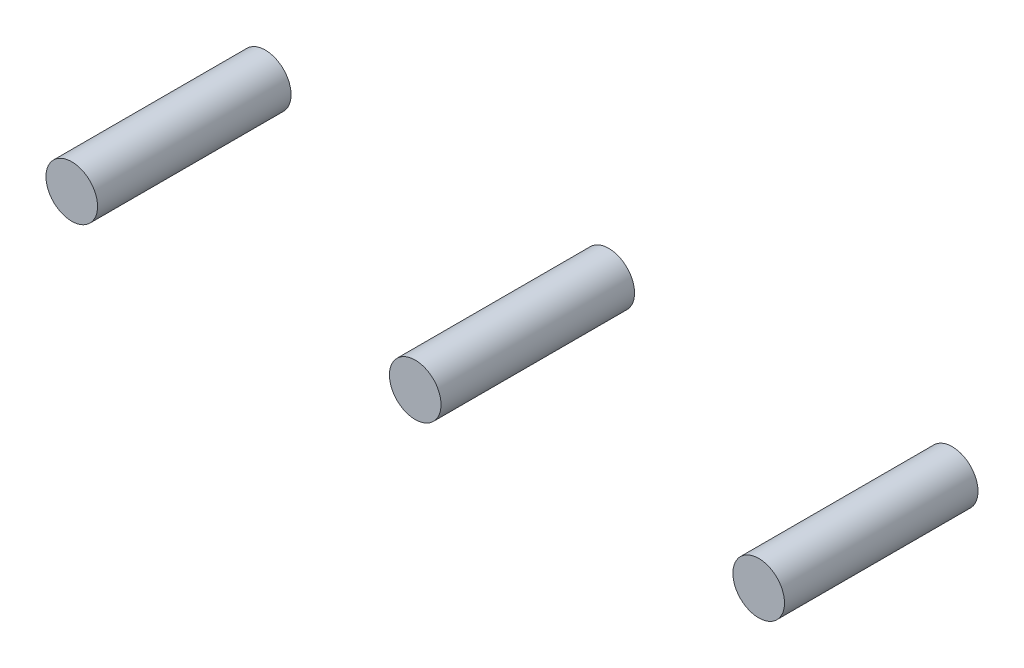
ISO-10303-21;
HEADER;
FILE_DESCRIPTION(('STEP AP214'),'2;1');
FILE_NAME('part.step','',(''),(''),'','','');
FILE_SCHEMA(('AUTOMOTIVE_DESIGN { 1 0 10303 214 1 1 1 1 }'));
ENDSEC;
DATA;
#1=APPLICATION_CONTEXT('core data for automotive mechanical design processes');
#2=APPLICATION_PROTOCOL_DEFINITION('international standard','automotive_design',2000,#1);
#3=PRODUCT_CONTEXT('',#1,'mechanical');
#4=PRODUCT('Part','Part','',(#3));
#5=PRODUCT_RELATED_PRODUCT_CATEGORY('part','',(#4));
#6=PRODUCT_DEFINITION_FORMATION('','',#4);
#7=PRODUCT_DEFINITION_CONTEXT('part definition',#1,'design');
#8=PRODUCT_DEFINITION('design','',#6,#7);
#9=PRODUCT_DEFINITION_SHAPE('','',#8);
#10=(LENGTH_UNIT() NAMED_UNIT(*) SI_UNIT(.MILLI.,.METRE.));
#11=(NAMED_UNIT(*) PLANE_ANGLE_UNIT() SI_UNIT($,.RADIAN.));
#12=(NAMED_UNIT(*) SI_UNIT($,.STERADIAN.) SOLID_ANGLE_UNIT());
#13=UNCERTAINTY_MEASURE_WITH_UNIT(LENGTH_MEASURE(1.E-05),#10,'distance_accuracy_value','');
#14=(GEOMETRIC_REPRESENTATION_CONTEXT(3) GLOBAL_UNCERTAINTY_ASSIGNED_CONTEXT((#13)) GLOBAL_UNIT_ASSIGNED_CONTEXT((#10,
#11,#12)) REPRESENTATION_CONTEXT('',''));
#15=CARTESIAN_POINT('',(0.,0.,0.));
#16=DIRECTION('',(0.,0.,1.));
#17=DIRECTION('',(1.,0.,0.));
#18=AXIS2_PLACEMENT_3D('',#15,#16,#17);
#19=CARTESIAN_POINT('',(5.325,2.875,3.));
#20=DIRECTION('',(0.,0.,-1.));
#21=DIRECTION('',(-1.,0.,0.));
#22=AXIS2_PLACEMENT_3D('',#19,#20,#21);
#23=CYLINDRICAL_SURFACE('',#22,0.4);
#24=CARTESIAN_POINT('',(5.325,2.875,3.));
#25=DIRECTION('',(0.,0.,1.));
#26=DIRECTION('',(1.,0.,0.));
#27=AXIS2_PLACEMENT_3D('',#24,#25,#26);
#28=CIRCLE('',#27,0.4);
#29=CARTESIAN_POINT('',(5.725,2.875,3.));
#30=VERTEX_POINT('',#29);
#31=EDGE_CURVE('E11',#30,#30,#28,.T.);
#32=ORIENTED_EDGE('',*,*,#31,.F.);
#33=EDGE_LOOP('',(#32));
#34=FACE_BOUND('',#33,.T.);
#35=CARTESIAN_POINT('',(5.325,2.875,0.));
#36=DIRECTION('',(0.,0.,1.));
#37=DIRECTION('',(1.,0.,0.));
#38=AXIS2_PLACEMENT_3D('',#35,#36,#37);
#39=CIRCLE('',#38,0.4);
#40=CARTESIAN_POINT('',(5.725,2.875,0.));
#41=VERTEX_POINT('',#40);
#42=EDGE_CURVE('E43',#41,#41,#39,.T.);
#43=ORIENTED_EDGE('',*,*,#42,.T.);
#44=EDGE_LOOP('',(#43));
#45=FACE_BOUND('',#44,.T.);
#46=ADVANCED_FACE('F40',(#34,#45),#23,.T.);
#47=CARTESIAN_POINT('',(5.325,2.875,3.));
#48=DIRECTION('',(0.,0.,1.));
#49=DIRECTION('',(1.,0.,0.));
#50=AXIS2_PLACEMENT_3D('',#47,#48,#49);
#51=PLANE('',#50);
#52=ORIENTED_EDGE('',*,*,#31,.T.);
#53=EDGE_LOOP('',(#52));
#54=FACE_BOUND('',#53,.T.);
#55=ADVANCED_FACE('F55',(#54),#51,.T.);
#56=CARTESIAN_POINT('',(5.325,2.875,0.));
#57=DIRECTION('',(0.,0.,1.));
#58=DIRECTION('',(1.,0.,0.));
#59=AXIS2_PLACEMENT_3D('',#56,#57,#58);
#60=PLANE('',#59);
#61=ORIENTED_EDGE('',*,*,#42,.F.);
#62=EDGE_LOOP('',(#61));
#63=FACE_BOUND('',#62,.T.);
#64=ADVANCED_FACE('F53',(#63),#60,.F.);
#65=CLOSED_SHELL('',(#46,#55,#64));
#66=MANIFOLD_SOLID_BREP('B2',#65);
#67=CARTESIAN_POINT('',(-5.325,2.875,3.));
#68=DIRECTION('',(0.,0.,-1.));
#69=DIRECTION('',(-1.,0.,0.));
#70=AXIS2_PLACEMENT_3D('',#67,#68,#69);
#71=CYLINDRICAL_SURFACE('',#70,0.4);
#72=CARTESIAN_POINT('',(-5.325,2.875,3.));
#73=DIRECTION('',(0.,0.,1.));
#74=DIRECTION('',(1.,0.,0.));
#75=AXIS2_PLACEMENT_3D('',#72,#73,#74);
#76=CIRCLE('',#75,0.4);
#77=CARTESIAN_POINT('',(-4.925,2.875,3.));
#78=VERTEX_POINT('',#77);
#79=EDGE_CURVE('E39',#78,#78,#76,.T.);
#80=ORIENTED_EDGE('',*,*,#79,.F.);
#81=EDGE_LOOP('',(#80));
#82=FACE_BOUND('',#81,.T.);
#83=CARTESIAN_POINT('',(-5.325,2.875,0.));
#84=DIRECTION('',(0.,0.,1.));
#85=DIRECTION('',(1.,0.,0.));
#86=AXIS2_PLACEMENT_3D('',#83,#84,#85);
#87=CIRCLE('',#86,0.4);
#88=CARTESIAN_POINT('',(-4.925,2.875,0.));
#89=VERTEX_POINT('',#88);
#90=EDGE_CURVE('E91',#89,#89,#87,.T.);
#91=ORIENTED_EDGE('',*,*,#90,.T.);
#92=EDGE_LOOP('',(#91));
#93=FACE_BOUND('',#92,.T.);
#94=ADVANCED_FACE('F88',(#82,#93),#71,.T.);
#95=CARTESIAN_POINT('',(-5.325,2.875,3.));
#96=DIRECTION('',(0.,0.,1.));
#97=DIRECTION('',(1.,0.,0.));
#98=AXIS2_PLACEMENT_3D('',#95,#96,#97);
#99=PLANE('',#98);
#100=ORIENTED_EDGE('',*,*,#79,.T.);
#101=EDGE_LOOP('',(#100));
#102=FACE_BOUND('',#101,.T.);
#103=ADVANCED_FACE('F103',(#102),#99,.T.);
#104=CARTESIAN_POINT('',(-5.325,2.875,0.));
#105=DIRECTION('',(0.,0.,1.));
#106=DIRECTION('',(1.,0.,0.));
#107=AXIS2_PLACEMENT_3D('',#104,#105,#106);
#108=PLANE('',#107);
#109=ORIENTED_EDGE('',*,*,#90,.F.);
#110=EDGE_LOOP('',(#109));
#111=FACE_BOUND('',#110,.T.);
#112=ADVANCED_FACE('F101',(#111),#108,.F.);
#113=CLOSED_SHELL('',(#94,#103,#112));
#114=MANIFOLD_SOLID_BREP('B6',#113);
#115=CARTESIAN_POINT('',(0.,2.875,3.));
#116=DIRECTION('',(0.,0.,-1.));
#117=DIRECTION('',(-1.,0.,0.));
#118=AXIS2_PLACEMENT_3D('',#115,#116,#117);
#119=CYLINDRICAL_SURFACE('',#118,0.4);
#120=CARTESIAN_POINT('',(0.,2.875,3.));
#121=DIRECTION('',(0.,0.,1.));
#122=DIRECTION('',(1.,0.,0.));
#123=AXIS2_PLACEMENT_3D('',#120,#121,#122);
#124=CIRCLE('',#123,0.4);
#125=CARTESIAN_POINT('',(0.400000000000001,2.875,3.));
#126=VERTEX_POINT('',#125);
#127=EDGE_CURVE('E87',#126,#126,#124,.T.);
#128=ORIENTED_EDGE('',*,*,#127,.F.);
#129=EDGE_LOOP('',(#128));
#130=FACE_BOUND('',#129,.T.);
#131=CARTESIAN_POINT('',(0.,2.875,0.));
#132=DIRECTION('',(0.,0.,1.));
#133=DIRECTION('',(1.,0.,0.));
#134=AXIS2_PLACEMENT_3D('',#131,#132,#133);
#135=CIRCLE('',#134,0.4);
#136=CARTESIAN_POINT('',(0.400000000000001,2.875,0.));
#137=VERTEX_POINT('',#136);
#138=EDGE_CURVE('E132',#137,#137,#135,.T.);
#139=ORIENTED_EDGE('',*,*,#138,.T.);
#140=EDGE_LOOP('',(#139));
#141=FACE_BOUND('',#140,.T.);
#142=ADVANCED_FACE('F129',(#130,#141),#119,.T.);
#143=CARTESIAN_POINT('',(0.,2.875,3.));
#144=DIRECTION('',(0.,0.,1.));
#145=DIRECTION('',(1.,0.,0.));
#146=AXIS2_PLACEMENT_3D('',#143,#144,#145);
#147=PLANE('',#146);
#148=ORIENTED_EDGE('',*,*,#127,.T.);
#149=EDGE_LOOP('',(#148));
#150=FACE_BOUND('',#149,.T.);
#151=ADVANCED_FACE('F144',(#150),#147,.T.);
#152=CARTESIAN_POINT('',(0.,2.875,0.));
#153=DIRECTION('',(0.,0.,1.));
#154=DIRECTION('',(1.,0.,0.));
#155=AXIS2_PLACEMENT_3D('',#152,#153,#154);
#156=PLANE('',#155);
#157=ORIENTED_EDGE('',*,*,#138,.F.);
#158=EDGE_LOOP('',(#157));
#159=FACE_BOUND('',#158,.T.);
#160=ADVANCED_FACE('F142',(#159),#156,.F.);
#161=CLOSED_SHELL('',(#142,#151,#160));
#162=MANIFOLD_SOLID_BREP('B34',#161);
#163=ADVANCED_BREP_SHAPE_REPRESENTATION('',(#18,#66,#114,#162),#14);
#164=SHAPE_DEFINITION_REPRESENTATION(#9,#163);
ENDSEC;
END-ISO-10303-21;
